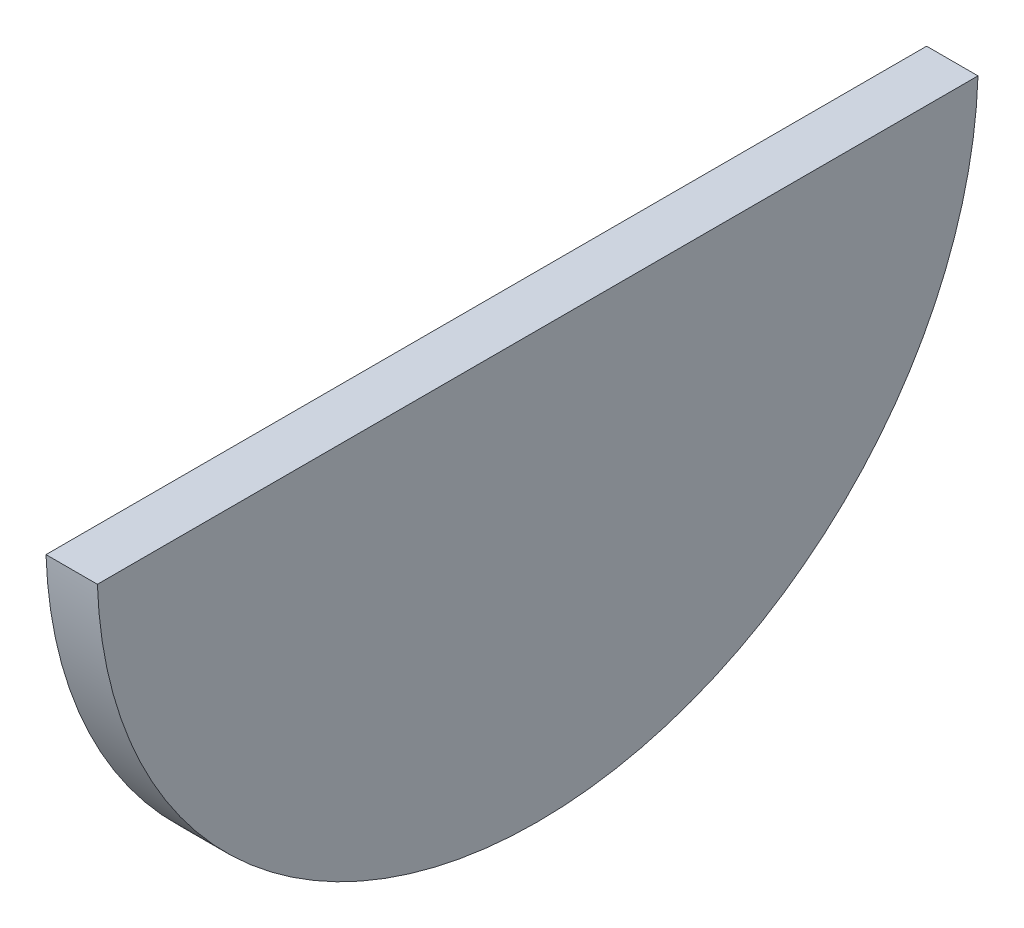
ISO-10303-21;
HEADER;
FILE_DESCRIPTION(('STEP AP214'),'2;1');
FILE_NAME('part.step','',(''),(''),'','','');
FILE_SCHEMA(('AUTOMOTIVE_DESIGN { 1 0 10303 214 1 1 1 1 }'));
ENDSEC;
DATA;
#1=APPLICATION_CONTEXT('core data for automotive mechanical design processes');
#2=APPLICATION_PROTOCOL_DEFINITION('international standard','automotive_design',2000,#1);
#3=PRODUCT_CONTEXT('',#1,'mechanical');
#4=PRODUCT('Part','Part','',(#3));
#5=PRODUCT_RELATED_PRODUCT_CATEGORY('part','',(#4));
#6=PRODUCT_DEFINITION_FORMATION('','',#4);
#7=PRODUCT_DEFINITION_CONTEXT('part definition',#1,'design');
#8=PRODUCT_DEFINITION('design','',#6,#7);
#9=PRODUCT_DEFINITION_SHAPE('','',#8);
#10=(LENGTH_UNIT() NAMED_UNIT(*) SI_UNIT(.MILLI.,.METRE.));
#11=(NAMED_UNIT(*) PLANE_ANGLE_UNIT() SI_UNIT($,.RADIAN.));
#12=(NAMED_UNIT(*) SI_UNIT($,.STERADIAN.) SOLID_ANGLE_UNIT());
#13=UNCERTAINTY_MEASURE_WITH_UNIT(LENGTH_MEASURE(1.E-05),#10,'distance_accuracy_value','');
#14=(GEOMETRIC_REPRESENTATION_CONTEXT(3) GLOBAL_UNCERTAINTY_ASSIGNED_CONTEXT((#13)) GLOBAL_UNIT_ASSIGNED_CONTEXT((#10,
#11,#12)) REPRESENTATION_CONTEXT('',''));
#15=CARTESIAN_POINT('',(0.,0.,0.));
#16=DIRECTION('',(0.,0.,1.));
#17=DIRECTION('',(1.,0.,0.));
#18=AXIS2_PLACEMENT_3D('',#15,#16,#17);
#19=CARTESIAN_POINT('',(8.89,2.54,0.));
#20=DIRECTION('',(-1.,0.,0.));
#21=DIRECTION('',(0.,0.,1.));
#22=AXIS2_PLACEMENT_3D('',#19,#20,#21);
#23=CYLINDRICAL_SURFACE('',#22,76.2);
#24=CARTESIAN_POINT('',(0.,2.54,0.));
#25=DIRECTION('',(1.,0.,0.));
#26=DIRECTION('',(0.,0.,-1.));
#27=AXIS2_PLACEMENT_3D('',#24,#25,#26);
#28=CIRCLE('',#27,76.2);
#29=CARTESIAN_POINT('',(0.,0.,76.15765490087));
#30=VERTEX_POINT('',#29);
#31=CARTESIAN_POINT('',(0.,0.,-76.15765490087));
#32=VERTEX_POINT('',#31);
#33=EDGE_CURVE('E76',#30,#32,#28,.T.);
#34=ORIENTED_EDGE('',*,*,#33,.T.);
#35=DIRECTION('',(-1.,0.,0.));
#36=VECTOR('',#35,1.);
#37=CARTESIAN_POINT('',(8.89,0.,-76.15765490087));
#38=LINE('',#37,#36);
#39=CARTESIAN_POINT('',(8.89,0.,-76.15765490087));
#40=VERTEX_POINT('',#39);
#41=EDGE_CURVE('E11',#40,#32,#38,.T.);
#42=ORIENTED_EDGE('',*,*,#41,.F.);
#43=CARTESIAN_POINT('',(8.89,2.54,0.));
#44=DIRECTION('',(1.,0.,0.));
#45=DIRECTION('',(0.,0.,-1.));
#46=AXIS2_PLACEMENT_3D('',#43,#44,#45);
#47=CIRCLE('',#46,76.2);
#48=CARTESIAN_POINT('',(8.89,0.,76.15765490087));
#49=VERTEX_POINT('',#48);
#50=EDGE_CURVE('E75',#49,#40,#47,.T.);
#51=ORIENTED_EDGE('',*,*,#50,.F.);
#52=DIRECTION('',(-1.,0.,0.));
#53=VECTOR('',#52,1.);
#54=CARTESIAN_POINT('',(8.89,0.,76.15765490087));
#55=LINE('',#54,#53);
#56=EDGE_CURVE('E52',#49,#30,#55,.T.);
#57=ORIENTED_EDGE('',*,*,#56,.T.);
#58=EDGE_LOOP('',(#34,#42,#51,#57));
#59=FACE_BOUND('',#58,.T.);
#60=ADVANCED_FACE('F43',(#59),#23,.T.);
#61=CARTESIAN_POINT('',(8.89,0.,-76.15765490087));
#62=DIRECTION('',(0.,-1.,0.));
#63=DIRECTION('',(0.,0.,-1.));
#64=AXIS2_PLACEMENT_3D('',#61,#62,#63);
#65=PLANE('',#64);
#66=DIRECTION('',(0.,0.,1.));
#67=VECTOR('',#66,1.);
#68=CARTESIAN_POINT('',(0.,0.,-76.15765490087));
#69=LINE('',#68,#67);
#70=EDGE_CURVE('E67',#32,#30,#69,.T.);
#71=ORIENTED_EDGE('',*,*,#70,.T.);
#72=ORIENTED_EDGE('',*,*,#56,.F.);
#73=DIRECTION('',(0.,0.,1.));
#74=VECTOR('',#73,1.);
#75=CARTESIAN_POINT('',(8.89,0.,-76.15765490087));
#76=LINE('',#75,#74);
#77=EDGE_CURVE('E59',#40,#49,#76,.T.);
#78=ORIENTED_EDGE('',*,*,#77,.F.);
#79=ORIENTED_EDGE('',*,*,#41,.T.);
#80=EDGE_LOOP('',(#71,#72,#78,#79));
#81=FACE_BOUND('',#80,.T.);
#82=ADVANCED_FACE('F70',(#81),#65,.F.);
#83=CARTESIAN_POINT('',(8.89,2.54,0.));
#84=DIRECTION('',(1.,0.,0.));
#85=DIRECTION('',(0.,0.,-1.));
#86=AXIS2_PLACEMENT_3D('',#83,#84,#85);
#87=PLANE('',#86);
#88=ORIENTED_EDGE('',*,*,#50,.T.);
#89=ORIENTED_EDGE('',*,*,#77,.T.);
#90=EDGE_LOOP('',(#88,#89));
#91=FACE_BOUND('',#90,.T.);
#92=ADVANCED_FACE('F87',(#91),#87,.T.);
#93=CARTESIAN_POINT('',(0.,2.54,0.));
#94=DIRECTION('',(1.,0.,0.));
#95=DIRECTION('',(0.,0.,-1.));
#96=AXIS2_PLACEMENT_3D('',#93,#94,#95);
#97=PLANE('',#96);
#98=ORIENTED_EDGE('',*,*,#33,.F.);
#99=ORIENTED_EDGE('',*,*,#70,.F.);
#100=EDGE_LOOP('',(#98,#99));
#101=FACE_BOUND('',#100,.T.);
#102=ADVANCED_FACE('F80',(#101),#97,.F.);
#103=CLOSED_SHELL('',(#60,#82,#92,#102));
#104=MANIFOLD_SOLID_BREP('B2',#103);
#105=ADVANCED_BREP_SHAPE_REPRESENTATION('',(#18,#104),#14);
#106=SHAPE_DEFINITION_REPRESENTATION(#9,#105);
ENDSEC;
END-ISO-10303-21;
